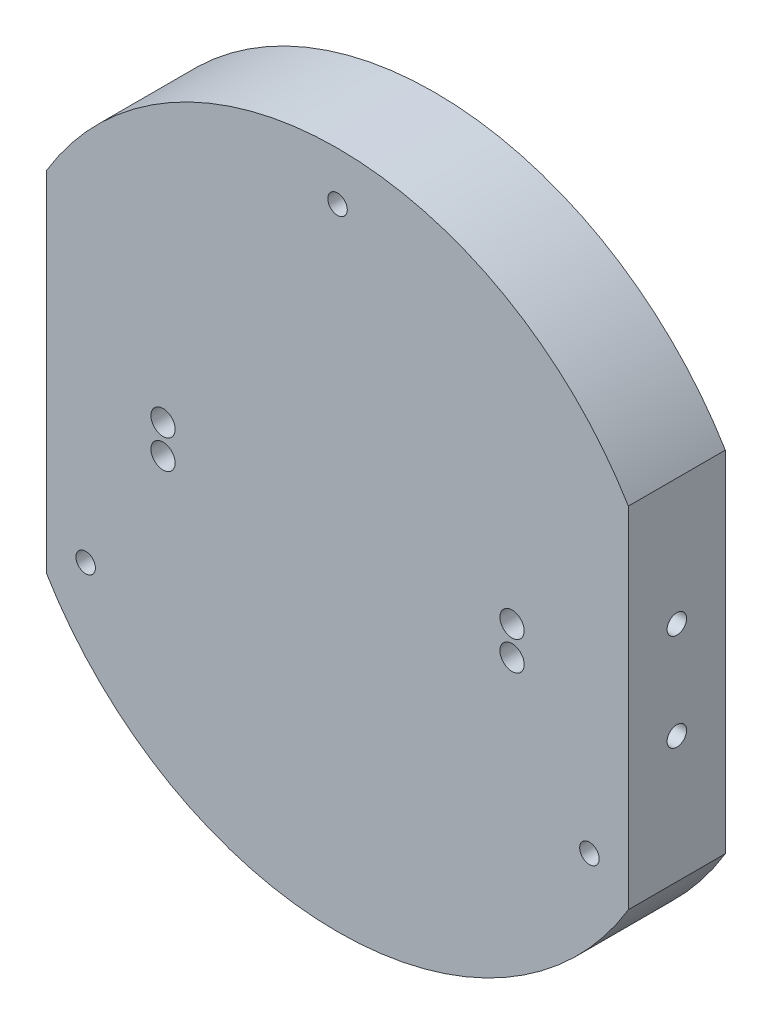
ISO-10303-21;
HEADER;
FILE_DESCRIPTION(('STEP AP214'),'2;1');
FILE_NAME('part.step','',(''),(''),'','','');
FILE_SCHEMA(('AUTOMOTIVE_DESIGN { 1 0 10303 214 1 1 1 1 }'));
ENDSEC;
DATA;
#1=APPLICATION_CONTEXT('core data for automotive mechanical design processes');
#2=APPLICATION_PROTOCOL_DEFINITION('international standard','automotive_design',2000,#1);
#3=PRODUCT_CONTEXT('',#1,'mechanical');
#4=PRODUCT('Part','Part','',(#3));
#5=PRODUCT_RELATED_PRODUCT_CATEGORY('part','',(#4));
#6=PRODUCT_DEFINITION_FORMATION('','',#4);
#7=PRODUCT_DEFINITION_CONTEXT('part definition',#1,'design');
#8=PRODUCT_DEFINITION('design','',#6,#7);
#9=PRODUCT_DEFINITION_SHAPE('','',#8);
#10=(LENGTH_UNIT() NAMED_UNIT(*) SI_UNIT(.MILLI.,.METRE.));
#11=(NAMED_UNIT(*) PLANE_ANGLE_UNIT() SI_UNIT($,.RADIAN.));
#12=(NAMED_UNIT(*) SI_UNIT($,.STERADIAN.) SOLID_ANGLE_UNIT());
#13=UNCERTAINTY_MEASURE_WITH_UNIT(LENGTH_MEASURE(1.E-05),#10,'distance_accuracy_value','');
#14=(GEOMETRIC_REPRESENTATION_CONTEXT(3) GLOBAL_UNCERTAINTY_ASSIGNED_CONTEXT((#13)) GLOBAL_UNIT_ASSIGNED_CONTEXT((#10,
#11,#12)) REPRESENTATION_CONTEXT('',''));
#15=CARTESIAN_POINT('',(0.,0.,0.));
#16=DIRECTION('',(0.,0.,1.));
#17=DIRECTION('',(1.,0.,0.));
#18=AXIS2_PLACEMENT_3D('',#15,#16,#17);
#19=CARTESIAN_POINT('',(88.9,-88.9,12.7));
#20=DIRECTION('',(0.,0.,1.));
#21=DIRECTION('',(1.,0.,0.));
#22=AXIS2_PLACEMENT_3D('',#19,#20,#21);
#23=PLANE('',#22);
#24=CARTESIAN_POINT('',(-45.72,-3.81,12.7));
#25=DIRECTION('',(0.,0.,1.));
#26=DIRECTION('',(1.,0.,0.));
#27=AXIS2_PLACEMENT_3D('',#24,#25,#26);
#28=CIRCLE('',#27,3.17499999999998);
#29=CARTESIAN_POINT('',(-42.545,-3.81,12.7));
#30=VERTEX_POINT('',#29);
#31=EDGE_CURVE('E153',#30,#30,#28,.T.);
#32=ORIENTED_EDGE('',*,*,#31,.F.);
#33=EDGE_LOOP('',(#32));
#34=FACE_BOUND('',#33,.T.);
#35=CARTESIAN_POINT('',(-45.72,3.81,12.7));
#36=DIRECTION('',(0.,0.,1.));
#37=DIRECTION('',(1.,0.,0.));
#38=AXIS2_PLACEMENT_3D('',#35,#36,#37);
#39=CIRCLE('',#38,3.17499999999998);
#40=CARTESIAN_POINT('',(-42.545,3.81,12.7));
#41=VERTEX_POINT('',#40);
#42=EDGE_CURVE('E156',#41,#41,#39,.T.);
#43=ORIENTED_EDGE('',*,*,#42,.F.);
#44=EDGE_LOOP('',(#43));
#45=FACE_BOUND('',#44,.T.);
#46=CARTESIAN_POINT('',(-65.9911357683746,-38.0999999999994,12.7));
#47=DIRECTION('',(0.,0.,-1.));
#48=DIRECTION('',(-1.,0.,0.));
#49=AXIS2_PLACEMENT_3D('',#46,#47,#48);
#50=CIRCLE('',#49,2.55269999999999);
#51=CARTESIAN_POINT('',(-68.5438357683746,-38.0999999999994,12.7));
#52=VERTEX_POINT('',#51);
#53=EDGE_CURVE('E166',#52,#52,#50,.T.);
#54=ORIENTED_EDGE('',*,*,#53,.T.);
#55=EDGE_LOOP('',(#54));
#56=FACE_BOUND('',#55,.T.);
#57=CARTESIAN_POINT('',(65.9911357683741,-38.1000000000003,12.7));
#58=DIRECTION('',(0.,0.,-1.));
#59=DIRECTION('',(-1.,0.,0.));
#60=AXIS2_PLACEMENT_3D('',#57,#58,#59);
#61=CIRCLE('',#60,2.55269999999999);
#62=CARTESIAN_POINT('',(63.4384357683741,-38.1000000000003,12.7));
#63=VERTEX_POINT('',#62);
#64=EDGE_CURVE('E169',#63,#63,#61,.T.);
#65=ORIENTED_EDGE('',*,*,#64,.T.);
#66=EDGE_LOOP('',(#65));
#67=FACE_BOUND('',#66,.T.);
#68=CARTESIAN_POINT('',(0.,76.2,12.7));
#69=DIRECTION('',(0.,0.,-1.));
#70=DIRECTION('',(-1.,0.,0.));
#71=AXIS2_PLACEMENT_3D('',#68,#69,#70);
#72=CIRCLE('',#71,2.5527);
#73=CARTESIAN_POINT('',(-2.5527,76.2,12.7));
#74=VERTEX_POINT('',#73);
#75=EDGE_CURVE('E98',#74,#74,#72,.T.);
#76=ORIENTED_EDGE('',*,*,#75,.T.);
#77=EDGE_LOOP('',(#76));
#78=FACE_BOUND('',#77,.T.);
#79=CARTESIAN_POINT('',(0.,0.,12.7));
#80=DIRECTION('',(0.,0.,1.));
#81=DIRECTION('',(1.,0.,0.));
#82=AXIS2_PLACEMENT_3D('',#79,#80,#81);
#83=CIRCLE('',#82,88.9);
#84=CARTESIAN_POINT('',(-76.2,-45.7905011983926,12.7));
#85=VERTEX_POINT('',#84);
#86=CARTESIAN_POINT('',(76.2,-45.7905011983927,12.7));
#87=VERTEX_POINT('',#86);
#88=EDGE_CURVE('E49',#85,#87,#83,.T.);
#89=ORIENTED_EDGE('',*,*,#88,.T.);
#90=DIRECTION('',(0.,1.,0.));
#91=VECTOR('',#90,1.);
#92=CARTESIAN_POINT('',(76.2,88.9,12.7));
#93=LINE('',#92,#91);
#94=CARTESIAN_POINT('',(76.2,45.7905011983927,12.7));
#95=VERTEX_POINT('',#94);
#96=EDGE_CURVE('E108',#87,#95,#93,.T.);
#97=ORIENTED_EDGE('',*,*,#96,.T.);
#98=CARTESIAN_POINT('',(-76.2,45.7905011983926,12.7));
#99=VERTEX_POINT('',#98);
#100=EDGE_CURVE('E54',#95,#99,#83,.T.);
#101=ORIENTED_EDGE('',*,*,#100,.T.);
#102=DIRECTION('',(0.,-1.,0.));
#103=VECTOR('',#102,1.);
#104=CARTESIAN_POINT('',(-76.2,88.9,12.7));
#105=LINE('',#104,#103);
#106=EDGE_CURVE('E94',#99,#85,#105,.T.);
#107=ORIENTED_EDGE('',*,*,#106,.T.);
#108=EDGE_LOOP('',(#89,#97,#101,#107));
#109=FACE_BOUND('',#108,.T.);
#110=CARTESIAN_POINT('',(45.72,3.81,12.7));
#111=DIRECTION('',(0.,0.,1.));
#112=DIRECTION('',(1.,0.,0.));
#113=AXIS2_PLACEMENT_3D('',#110,#111,#112);
#114=CIRCLE('',#113,3.17499999999998);
#115=CARTESIAN_POINT('',(48.895,3.81,12.7));
#116=VERTEX_POINT('',#115);
#117=EDGE_CURVE('E182',#116,#116,#114,.T.);
#118=ORIENTED_EDGE('',*,*,#117,.F.);
#119=EDGE_LOOP('',(#118));
#120=FACE_BOUND('',#119,.T.);
#121=CARTESIAN_POINT('',(45.72,-3.81,12.7));
#122=DIRECTION('',(0.,0.,1.));
#123=DIRECTION('',(1.,0.,0.));
#124=AXIS2_PLACEMENT_3D('',#121,#122,#123);
#125=CIRCLE('',#124,3.17499999999998);
#126=CARTESIAN_POINT('',(48.895,-3.81,12.7));
#127=VERTEX_POINT('',#126);
#128=EDGE_CURVE('E11',#127,#127,#125,.T.);
#129=ORIENTED_EDGE('',*,*,#128,.F.);
#130=EDGE_LOOP('',(#129));
#131=FACE_BOUND('',#130,.T.);
#132=ADVANCED_FACE('F34',(#34,#45,#56,#67,#78,#109,#120,#131),#23,.T.);
#133=CARTESIAN_POINT('',(0.,0.,0.));
#134=DIRECTION('',(0.,0.,1.));
#135=DIRECTION('',(1.,0.,0.));
#136=AXIS2_PLACEMENT_3D('',#133,#134,#135);
#137=CYLINDRICAL_SURFACE('',#136,88.9);
#138=DIRECTION('',(0.,0.,1.));
#139=VECTOR('',#138,1.);
#140=CARTESIAN_POINT('',(-76.2,-45.7905011983926,0.));
#141=LINE('',#140,#139);
#142=CARTESIAN_POINT('',(-76.2,-45.7905011983926,-12.7));
#143=VERTEX_POINT('',#142);
#144=EDGE_CURVE('E97',#85,#143,#141,.F.);
#145=ORIENTED_EDGE('',*,*,#144,.T.);
#146=CARTESIAN_POINT('',(0.,0.,-12.7));
#147=DIRECTION('',(0.,0.,-1.));
#148=DIRECTION('',(-1.,0.,0.));
#149=AXIS2_PLACEMENT_3D('',#146,#147,#148);
#150=CIRCLE('',#149,88.9);
#151=CARTESIAN_POINT('',(76.2,-45.7905011983927,-12.7));
#152=VERTEX_POINT('',#151);
#153=EDGE_CURVE('E107',#152,#143,#150,.T.);
#154=ORIENTED_EDGE('',*,*,#153,.F.);
#155=DIRECTION('',(0.,0.,1.));
#156=VECTOR('',#155,1.);
#157=CARTESIAN_POINT('',(76.2,-45.7905011983927,0.));
#158=LINE('',#157,#156);
#159=EDGE_CURVE('E175',#152,#87,#158,.T.);
#160=ORIENTED_EDGE('',*,*,#159,.T.);
#161=ORIENTED_EDGE('',*,*,#88,.F.);
#162=EDGE_LOOP('',(#145,#154,#160,#161));
#163=FACE_BOUND('',#162,.T.);
#164=ADVANCED_FACE('F196',(#163),#137,.T.);
#165=DIRECTION('',(0.,0.,1.));
#166=VECTOR('',#165,1.);
#167=CARTESIAN_POINT('',(76.2,45.7905011983927,0.));
#168=LINE('',#167,#166);
#169=CARTESIAN_POINT('',(76.2,45.7905011983927,-12.7));
#170=VERTEX_POINT('',#169);
#171=EDGE_CURVE('E112',#95,#170,#168,.F.);
#172=ORIENTED_EDGE('',*,*,#171,.T.);
#173=CARTESIAN_POINT('',(0.,0.,-12.7));
#174=DIRECTION('',(0.,0.,-1.));
#175=DIRECTION('',(-1.,0.,0.));
#176=AXIS2_PLACEMENT_3D('',#173,#174,#175);
#177=CIRCLE('',#176,88.9);
#178=CARTESIAN_POINT('',(-76.2,45.7905011983926,-12.7));
#179=VERTEX_POINT('',#178);
#180=EDGE_CURVE('E105',#179,#170,#177,.T.);
#181=ORIENTED_EDGE('',*,*,#180,.F.);
#182=DIRECTION('',(0.,0.,1.));
#183=VECTOR('',#182,1.);
#184=CARTESIAN_POINT('',(-76.2,45.7905011983926,0.));
#185=LINE('',#184,#183);
#186=EDGE_CURVE('E88',#179,#99,#185,.T.);
#187=ORIENTED_EDGE('',*,*,#186,.T.);
#188=ORIENTED_EDGE('',*,*,#100,.F.);
#189=EDGE_LOOP('',(#172,#181,#187,#188));
#190=FACE_BOUND('',#189,.T.);
#191=ADVANCED_FACE('F111',(#190),#137,.T.);
#192=CARTESIAN_POINT('',(0.,76.2,0.));
#193=DIRECTION('',(0.,0.,-1.));
#194=DIRECTION('',(-1.,0.,0.));
#195=AXIS2_PLACEMENT_3D('',#192,#193,#194);
#196=CYLINDRICAL_SURFACE('',#195,2.5527);
#197=ORIENTED_EDGE('',*,*,#75,.F.);
#198=EDGE_LOOP('',(#197));
#199=FACE_BOUND('',#198,.T.);
#200=CARTESIAN_POINT('',(0.,76.2,-12.7));
#201=DIRECTION('',(0.,0.,-1.));
#202=DIRECTION('',(-1.,0.,0.));
#203=AXIS2_PLACEMENT_3D('',#200,#201,#202);
#204=CIRCLE('',#203,2.5527);
#205=CARTESIAN_POINT('',(-2.5527,76.2,-12.7));
#206=VERTEX_POINT('',#205);
#207=EDGE_CURVE('E115',#206,#206,#204,.T.);
#208=ORIENTED_EDGE('',*,*,#207,.T.);
#209=EDGE_LOOP('',(#208));
#210=FACE_BOUND('',#209,.T.);
#211=ADVANCED_FACE('F207',(#199,#210),#196,.F.);
#212=CARTESIAN_POINT('',(65.9911357683741,-38.1000000000003,0.));
#213=DIRECTION('',(0.,0.,-1.));
#214=DIRECTION('',(-1.,0.,0.));
#215=AXIS2_PLACEMENT_3D('',#212,#213,#214);
#216=CYLINDRICAL_SURFACE('',#215,2.5527);
#217=ORIENTED_EDGE('',*,*,#64,.F.);
#218=EDGE_LOOP('',(#217));
#219=FACE_BOUND('',#218,.T.);
#220=CARTESIAN_POINT('',(65.9911357683741,-38.1000000000003,-12.7));
#221=DIRECTION('',(0.,0.,-1.));
#222=DIRECTION('',(-1.,0.,0.));
#223=AXIS2_PLACEMENT_3D('',#220,#221,#222);
#224=CIRCLE('',#223,2.55270000000001);
#225=CARTESIAN_POINT('',(63.4384357683741,-38.1000000000003,-12.7));
#226=VERTEX_POINT('',#225);
#227=EDGE_CURVE('E118',#226,#226,#224,.T.);
#228=ORIENTED_EDGE('',*,*,#227,.T.);
#229=EDGE_LOOP('',(#228));
#230=FACE_BOUND('',#229,.T.);
#231=ADVANCED_FACE('F240',(#219,#230),#216,.F.);
#232=CARTESIAN_POINT('',(-65.9911357683746,-38.0999999999994,0.));
#233=DIRECTION('',(0.,0.,-1.));
#234=DIRECTION('',(-1.,0.,0.));
#235=AXIS2_PLACEMENT_3D('',#232,#233,#234);
#236=CYLINDRICAL_SURFACE('',#235,2.5527);
#237=ORIENTED_EDGE('',*,*,#53,.F.);
#238=EDGE_LOOP('',(#237));
#239=FACE_BOUND('',#238,.T.);
#240=CARTESIAN_POINT('',(-65.9911357683746,-38.0999999999994,-12.7));
#241=DIRECTION('',(0.,0.,-1.));
#242=DIRECTION('',(-1.,0.,0.));
#243=AXIS2_PLACEMENT_3D('',#240,#241,#242);
#244=CIRCLE('',#243,2.5527);
#245=CARTESIAN_POINT('',(-68.5438357683746,-38.0999999999994,-12.7));
#246=VERTEX_POINT('',#245);
#247=EDGE_CURVE('E114',#246,#246,#244,.T.);
#248=ORIENTED_EDGE('',*,*,#247,.T.);
#249=EDGE_LOOP('',(#248));
#250=FACE_BOUND('',#249,.T.);
#251=ADVANCED_FACE('F237',(#239,#250),#236,.F.);
#252=CARTESIAN_POINT('',(-76.2,88.9,0.));
#253=DIRECTION('',(-1.,0.,0.));
#254=DIRECTION('',(0.,-1.,0.));
#255=AXIS2_PLACEMENT_3D('',#252,#253,#254);
#256=PLANE('',#255);
#257=DIRECTION('',(0.,1.,0.));
#258=VECTOR('',#257,1.);
#259=CARTESIAN_POINT('',(-76.2,-19.05,-12.7));
#260=LINE('',#259,#258);
#261=EDGE_CURVE('E92',#143,#179,#260,.T.);
#262=ORIENTED_EDGE('',*,*,#261,.F.);
#263=ORIENTED_EDGE('',*,*,#144,.F.);
#264=ORIENTED_EDGE('',*,*,#106,.F.);
#265=ORIENTED_EDGE('',*,*,#186,.F.);
#266=EDGE_LOOP('',(#262,#263,#264,#265));
#267=FACE_BOUND('',#266,.T.);
#268=CARTESIAN_POINT('',(-76.2,12.7,0.));
#269=DIRECTION('',(-1.,0.,0.));
#270=DIRECTION('',(0.,0.,1.));
#271=AXIS2_PLACEMENT_3D('',#268,#269,#270);
#272=CIRCLE('',#271,2.55269999999999);
#273=CARTESIAN_POINT('',(-76.2,12.7,2.55269999999999));
#274=VERTEX_POINT('',#273);
#275=EDGE_CURVE('E138',#274,#274,#272,.T.);
#276=ORIENTED_EDGE('',*,*,#275,.F.);
#277=EDGE_LOOP('',(#276));
#278=FACE_BOUND('',#277,.T.);
#279=CARTESIAN_POINT('',(-76.2,-12.7,0.));
#280=DIRECTION('',(-1.,0.,0.));
#281=DIRECTION('',(0.,0.,1.));
#282=AXIS2_PLACEMENT_3D('',#279,#280,#281);
#283=CIRCLE('',#282,2.55269999999999);
#284=CARTESIAN_POINT('',(-76.2,-12.7,2.55269999999999));
#285=VERTEX_POINT('',#284);
#286=EDGE_CURVE('E144',#285,#285,#283,.T.);
#287=ORIENTED_EDGE('',*,*,#286,.F.);
#288=EDGE_LOOP('',(#287));
#289=FACE_BOUND('',#288,.T.);
#290=ADVANCED_FACE('F90',(#267,#278,#289),#256,.T.);
#291=CARTESIAN_POINT('',(76.2,88.9,0.));
#292=DIRECTION('',(1.,0.,0.));
#293=DIRECTION('',(0.,1.,0.));
#294=AXIS2_PLACEMENT_3D('',#291,#292,#293);
#295=PLANE('',#294);
#296=DIRECTION('',(0.,-1.,0.));
#297=VECTOR('',#296,1.);
#298=CARTESIAN_POINT('',(76.2,-19.05,-12.7));
#299=LINE('',#298,#297);
#300=EDGE_CURVE('E109',#170,#152,#299,.T.);
#301=ORIENTED_EDGE('',*,*,#300,.F.);
#302=ORIENTED_EDGE('',*,*,#171,.F.);
#303=ORIENTED_EDGE('',*,*,#96,.F.);
#304=ORIENTED_EDGE('',*,*,#159,.F.);
#305=EDGE_LOOP('',(#301,#302,#303,#304));
#306=FACE_BOUND('',#305,.T.);
#307=CARTESIAN_POINT('',(76.2,12.7,0.));
#308=DIRECTION('',(1.,0.,0.));
#309=DIRECTION('',(0.,0.,-1.));
#310=AXIS2_PLACEMENT_3D('',#307,#308,#309);
#311=CIRCLE('',#310,2.55269999999999);
#312=CARTESIAN_POINT('',(76.2,12.7,-2.55269999999999));
#313=VERTEX_POINT('',#312);
#314=EDGE_CURVE('E125',#313,#313,#311,.T.);
#315=ORIENTED_EDGE('',*,*,#314,.F.);
#316=EDGE_LOOP('',(#315));
#317=FACE_BOUND('',#316,.T.);
#318=CARTESIAN_POINT('',(76.2,-12.7,0.));
#319=DIRECTION('',(1.,0.,0.));
#320=DIRECTION('',(0.,0.,-1.));
#321=AXIS2_PLACEMENT_3D('',#318,#319,#320);
#322=CIRCLE('',#321,2.55269999999999);
#323=CARTESIAN_POINT('',(76.2,-12.7,-2.55269999999999));
#324=VERTEX_POINT('',#323);
#325=EDGE_CURVE('E132',#324,#324,#322,.T.);
#326=ORIENTED_EDGE('',*,*,#325,.F.);
#327=EDGE_LOOP('',(#326));
#328=FACE_BOUND('',#327,.T.);
#329=ADVANCED_FACE('F223',(#306,#317,#328),#295,.T.);
#330=CARTESIAN_POINT('',(76.2,19.05,-12.7));
#331=DIRECTION('',(0.,0.,-1.));
#332=DIRECTION('',(-1.,0.,0.));
#333=AXIS2_PLACEMENT_3D('',#330,#331,#332);
#334=PLANE('',#333);
#335=CARTESIAN_POINT('',(-45.72,-3.81,-12.7));
#336=DIRECTION('',(0.,0.,1.));
#337=DIRECTION('',(1.,0.,0.));
#338=AXIS2_PLACEMENT_3D('',#335,#336,#337);
#339=CIRCLE('',#338,3.17499999999998);
#340=CARTESIAN_POINT('',(-42.545,-3.81,-12.7));
#341=VERTEX_POINT('',#340);
#342=EDGE_CURVE('E150',#341,#341,#339,.T.);
#343=ORIENTED_EDGE('',*,*,#342,.T.);
#344=EDGE_LOOP('',(#343));
#345=FACE_BOUND('',#344,.T.);
#346=CARTESIAN_POINT('',(-45.72,3.81,-12.7));
#347=DIRECTION('',(0.,0.,1.));
#348=DIRECTION('',(1.,0.,0.));
#349=AXIS2_PLACEMENT_3D('',#346,#347,#348);
#350=CIRCLE('',#349,3.17499999999998);
#351=CARTESIAN_POINT('',(-42.545,3.81,-12.7));
#352=VERTEX_POINT('',#351);
#353=EDGE_CURVE('E159',#352,#352,#350,.T.);
#354=ORIENTED_EDGE('',*,*,#353,.T.);
#355=EDGE_LOOP('',(#354));
#356=FACE_BOUND('',#355,.T.);
#357=ORIENTED_EDGE('',*,*,#300,.T.);
#358=ORIENTED_EDGE('',*,*,#153,.T.);
#359=ORIENTED_EDGE('',*,*,#261,.T.);
#360=ORIENTED_EDGE('',*,*,#180,.T.);
#361=EDGE_LOOP('',(#357,#358,#359,#360));
#362=FACE_BOUND('',#361,.T.);
#363=CARTESIAN_POINT('',(45.72,3.81,-12.7));
#364=DIRECTION('',(0.,0.,1.));
#365=DIRECTION('',(1.,0.,0.));
#366=AXIS2_PLACEMENT_3D('',#363,#364,#365);
#367=CIRCLE('',#366,3.17499999999998);
#368=CARTESIAN_POINT('',(48.895,3.81,-12.7));
#369=VERTEX_POINT('',#368);
#370=EDGE_CURVE('E179',#369,#369,#367,.T.);
#371=ORIENTED_EDGE('',*,*,#370,.T.);
#372=EDGE_LOOP('',(#371));
#373=FACE_BOUND('',#372,.T.);
#374=CARTESIAN_POINT('',(45.72,-3.81,-12.7));
#375=DIRECTION('',(0.,0.,1.));
#376=DIRECTION('',(1.,0.,0.));
#377=AXIS2_PLACEMENT_3D('',#374,#375,#376);
#378=CIRCLE('',#377,3.17499999999998);
#379=CARTESIAN_POINT('',(48.895,-3.81,-12.7));
#380=VERTEX_POINT('',#379);
#381=EDGE_CURVE('E42',#380,#380,#378,.T.);
#382=ORIENTED_EDGE('',*,*,#381,.T.);
#383=EDGE_LOOP('',(#382));
#384=FACE_BOUND('',#383,.T.);
#385=ORIENTED_EDGE('',*,*,#247,.F.);
#386=EDGE_LOOP('',(#385));
#387=FACE_BOUND('',#386,.T.);
#388=ORIENTED_EDGE('',*,*,#227,.F.);
#389=EDGE_LOOP('',(#388));
#390=FACE_BOUND('',#389,.T.);
#391=ORIENTED_EDGE('',*,*,#207,.F.);
#392=EDGE_LOOP('',(#391));
#393=FACE_BOUND('',#392,.T.);
#394=ADVANCED_FACE('F103',(#345,#356,#362,#373,#384,#387,#390,#393),#334,.T.);
#395=CARTESIAN_POINT('',(-45.72,3.81,12.7));
#396=DIRECTION('',(0.,0.,1.));
#397=DIRECTION('',(1.,0.,0.));
#398=AXIS2_PLACEMENT_3D('',#395,#396,#397);
#399=CYLINDRICAL_SURFACE('',#398,3.17499999999998);
#400=ORIENTED_EDGE('',*,*,#353,.F.);
#401=EDGE_LOOP('',(#400));
#402=FACE_BOUND('',#401,.T.);
#403=ORIENTED_EDGE('',*,*,#42,.T.);
#404=EDGE_LOOP('',(#403));
#405=FACE_BOUND('',#404,.T.);
#406=ADVANCED_FACE('F215',(#402,#405),#399,.F.);
#407=CARTESIAN_POINT('',(-45.72,-3.81,12.7));
#408=DIRECTION('',(0.,0.,1.));
#409=DIRECTION('',(1.,0.,0.));
#410=AXIS2_PLACEMENT_3D('',#407,#408,#409);
#411=CYLINDRICAL_SURFACE('',#410,3.17499999999998);
#412=ORIENTED_EDGE('',*,*,#342,.F.);
#413=EDGE_LOOP('',(#412));
#414=FACE_BOUND('',#413,.T.);
#415=ORIENTED_EDGE('',*,*,#31,.T.);
#416=EDGE_LOOP('',(#415));
#417=FACE_BOUND('',#416,.T.);
#418=ADVANCED_FACE('F210',(#414,#417),#411,.F.);
#419=CARTESIAN_POINT('',(45.72,3.81,12.7));
#420=DIRECTION('',(0.,0.,1.));
#421=DIRECTION('',(1.,0.,0.));
#422=AXIS2_PLACEMENT_3D('',#419,#420,#421);
#423=CYLINDRICAL_SURFACE('',#422,3.17499999999998);
#424=ORIENTED_EDGE('',*,*,#370,.F.);
#425=EDGE_LOOP('',(#424));
#426=FACE_BOUND('',#425,.T.);
#427=ORIENTED_EDGE('',*,*,#117,.T.);
#428=EDGE_LOOP('',(#427));
#429=FACE_BOUND('',#428,.T.);
#430=ADVANCED_FACE('F192',(#426,#429),#423,.F.);
#431=CARTESIAN_POINT('',(45.72,-3.81,12.7));
#432=DIRECTION('',(0.,0.,1.));
#433=DIRECTION('',(1.,0.,0.));
#434=AXIS2_PLACEMENT_3D('',#431,#432,#433);
#435=CYLINDRICAL_SURFACE('',#434,3.17499999999998);
#436=ORIENTED_EDGE('',*,*,#381,.F.);
#437=EDGE_LOOP('',(#436));
#438=FACE_BOUND('',#437,.T.);
#439=ORIENTED_EDGE('',*,*,#128,.T.);
#440=EDGE_LOOP('',(#439));
#441=FACE_BOUND('',#440,.T.);
#442=ADVANCED_FACE('F36',(#438,#441),#435,.F.);
#443=CARTESIAN_POINT('',(-57.15,-12.7,0.));
#444=DIRECTION('',(-1.,0.,0.));
#445=DIRECTION('',(0.,0.,1.));
#446=AXIS2_PLACEMENT_3D('',#443,#444,#445);
#447=CONICAL_SURFACE('',#446,2.5527,1.02974425867665);
#448=CARTESIAN_POINT('',(-55.6161830978084,-12.7,0.));
#449=VERTEX_POINT('',#448);
#450=VERTEX_LOOP('',#449);
#451=FACE_BOUND('',#450,.T.);
#452=CARTESIAN_POINT('',(-57.15,-12.7,0.));
#453=DIRECTION('',(-1.,0.,0.));
#454=DIRECTION('',(0.,0.,1.));
#455=AXIS2_PLACEMENT_3D('',#452,#453,#454);
#456=CIRCLE('',#455,2.5527);
#457=CARTESIAN_POINT('',(-57.15,-12.7,2.5527));
#458=VERTEX_POINT('',#457);
#459=EDGE_CURVE('E147',#458,#458,#456,.T.);
#460=ORIENTED_EDGE('',*,*,#459,.T.);
#461=EDGE_LOOP('',(#460));
#462=FACE_BOUND('',#461,.T.);
#463=ADVANCED_FACE('F191',(#451,#462),#447,.F.);
#464=CARTESIAN_POINT('',(-76.2,-12.7,0.));
#465=DIRECTION('',(-1.,0.,0.));
#466=DIRECTION('',(0.,0.,1.));
#467=AXIS2_PLACEMENT_3D('',#464,#465,#466);
#468=CYLINDRICAL_SURFACE('',#467,2.55269999999999);
#469=ORIENTED_EDGE('',*,*,#459,.F.);
#470=EDGE_LOOP('',(#469));
#471=FACE_BOUND('',#470,.T.);
#472=ORIENTED_EDGE('',*,*,#286,.T.);
#473=EDGE_LOOP('',(#472));
#474=FACE_BOUND('',#473,.T.);
#475=ADVANCED_FACE('F332',(#471,#474),#468,.F.);
#476=CARTESIAN_POINT('',(-57.15,12.7,0.));
#477=DIRECTION('',(-1.,0.,0.));
#478=DIRECTION('',(0.,0.,1.));
#479=AXIS2_PLACEMENT_3D('',#476,#477,#478);
#480=CONICAL_SURFACE('',#479,2.5527,1.02974425867665);
#481=CARTESIAN_POINT('',(-55.6161830978084,12.7,0.));
#482=VERTEX_POINT('',#481);
#483=VERTEX_LOOP('',#482);
#484=FACE_BOUND('',#483,.T.);
#485=CARTESIAN_POINT('',(-57.15,12.7,0.));
#486=DIRECTION('',(-1.,0.,0.));
#487=DIRECTION('',(0.,0.,1.));
#488=AXIS2_PLACEMENT_3D('',#485,#486,#487);
#489=CIRCLE('',#488,2.5527);
#490=CARTESIAN_POINT('',(-57.15,12.7,2.5527));
#491=VERTEX_POINT('',#490);
#492=EDGE_CURVE('E141',#491,#491,#489,.T.);
#493=ORIENTED_EDGE('',*,*,#492,.T.);
#494=EDGE_LOOP('',(#493));
#495=FACE_BOUND('',#494,.T.);
#496=ADVANCED_FACE('F321',(#484,#495),#480,.F.);
#497=CARTESIAN_POINT('',(-76.2,12.7,0.));
#498=DIRECTION('',(-1.,0.,0.));
#499=DIRECTION('',(0.,0.,1.));
#500=AXIS2_PLACEMENT_3D('',#497,#498,#499);
#501=CYLINDRICAL_SURFACE('',#500,2.55269999999999);
#502=ORIENTED_EDGE('',*,*,#492,.F.);
#503=EDGE_LOOP('',(#502));
#504=FACE_BOUND('',#503,.T.);
#505=ORIENTED_EDGE('',*,*,#275,.T.);
#506=EDGE_LOOP('',(#505));
#507=FACE_BOUND('',#506,.T.);
#508=ADVANCED_FACE('F311',(#504,#507),#501,.F.);
#509=CARTESIAN_POINT('',(57.15,-12.7,0.));
#510=DIRECTION('',(1.,0.,0.));
#511=DIRECTION('',(0.,0.,-1.));
#512=AXIS2_PLACEMENT_3D('',#509,#510,#511);
#513=CONICAL_SURFACE('',#512,2.5527,1.02974425867665);
#514=CARTESIAN_POINT('',(55.6161830978083,-12.7,0.));
#515=VERTEX_POINT('',#514);
#516=VERTEX_LOOP('',#515);
#517=FACE_BOUND('',#516,.T.);
#518=CARTESIAN_POINT('',(57.15,-12.7,0.));
#519=DIRECTION('',(1.,0.,0.));
#520=DIRECTION('',(0.,0.,-1.));
#521=AXIS2_PLACEMENT_3D('',#518,#519,#520);
#522=CIRCLE('',#521,2.5527);
#523=CARTESIAN_POINT('',(57.15,-12.7,-2.5527));
#524=VERTEX_POINT('',#523);
#525=EDGE_CURVE('E135',#524,#524,#522,.T.);
#526=ORIENTED_EDGE('',*,*,#525,.T.);
#527=EDGE_LOOP('',(#526));
#528=FACE_BOUND('',#527,.T.);
#529=ADVANCED_FACE('F300',(#517,#528),#513,.F.);
#530=CARTESIAN_POINT('',(76.2,-12.7,0.));
#531=DIRECTION('',(1.,0.,0.));
#532=DIRECTION('',(0.,0.,-1.));
#533=AXIS2_PLACEMENT_3D('',#530,#531,#532);
#534=CYLINDRICAL_SURFACE('',#533,2.55269999999999);
#535=ORIENTED_EDGE('',*,*,#525,.F.);
#536=EDGE_LOOP('',(#535));
#537=FACE_BOUND('',#536,.T.);
#538=ORIENTED_EDGE('',*,*,#325,.T.);
#539=EDGE_LOOP('',(#538));
#540=FACE_BOUND('',#539,.T.);
#541=ADVANCED_FACE('F290',(#537,#540),#534,.F.);
#542=CARTESIAN_POINT('',(57.15,12.7,0.));
#543=DIRECTION('',(1.,0.,0.));
#544=DIRECTION('',(0.,0.,-1.));
#545=AXIS2_PLACEMENT_3D('',#542,#543,#544);
#546=CONICAL_SURFACE('',#545,2.5527,1.02974425867665);
#547=CARTESIAN_POINT('',(55.6161830978083,12.7,0.));
#548=VERTEX_POINT('',#547);
#549=VERTEX_LOOP('',#548);
#550=FACE_BOUND('',#549,.T.);
#551=CARTESIAN_POINT('',(57.15,12.7,0.));
#552=DIRECTION('',(1.,0.,0.));
#553=DIRECTION('',(0.,0.,-1.));
#554=AXIS2_PLACEMENT_3D('',#551,#552,#553);
#555=CIRCLE('',#554,2.5527);
#556=CARTESIAN_POINT('',(57.15,12.7,-2.5527));
#557=VERTEX_POINT('',#556);
#558=EDGE_CURVE('E129',#557,#557,#555,.T.);
#559=ORIENTED_EDGE('',*,*,#558,.T.);
#560=EDGE_LOOP('',(#559));
#561=FACE_BOUND('',#560,.T.);
#562=ADVANCED_FACE('F279',(#550,#561),#546,.F.);
#563=CARTESIAN_POINT('',(76.2,12.7,0.));
#564=DIRECTION('',(1.,0.,0.));
#565=DIRECTION('',(0.,0.,-1.));
#566=AXIS2_PLACEMENT_3D('',#563,#564,#565);
#567=CYLINDRICAL_SURFACE('',#566,2.55269999999999);
#568=ORIENTED_EDGE('',*,*,#558,.F.);
#569=EDGE_LOOP('',(#568));
#570=FACE_BOUND('',#569,.T.);
#571=ORIENTED_EDGE('',*,*,#314,.T.);
#572=EDGE_LOOP('',(#571));
#573=FACE_BOUND('',#572,.T.);
#574=ADVANCED_FACE('F274',(#570,#573),#567,.F.);
#575=CLOSED_SHELL('',(#132,#164,#191,#211,#231,#251,#290,#329,#394,#406,#418,#430,#442,#463,
#475,#496,#508,#529,#541,#562,#574));
#576=MANIFOLD_SOLID_BREP('B2',#575);
#577=ADVANCED_BREP_SHAPE_REPRESENTATION('',(#18,#576),#14);
#578=SHAPE_DEFINITION_REPRESENTATION(#9,#577);
ENDSEC;
END-ISO-10303-21;
